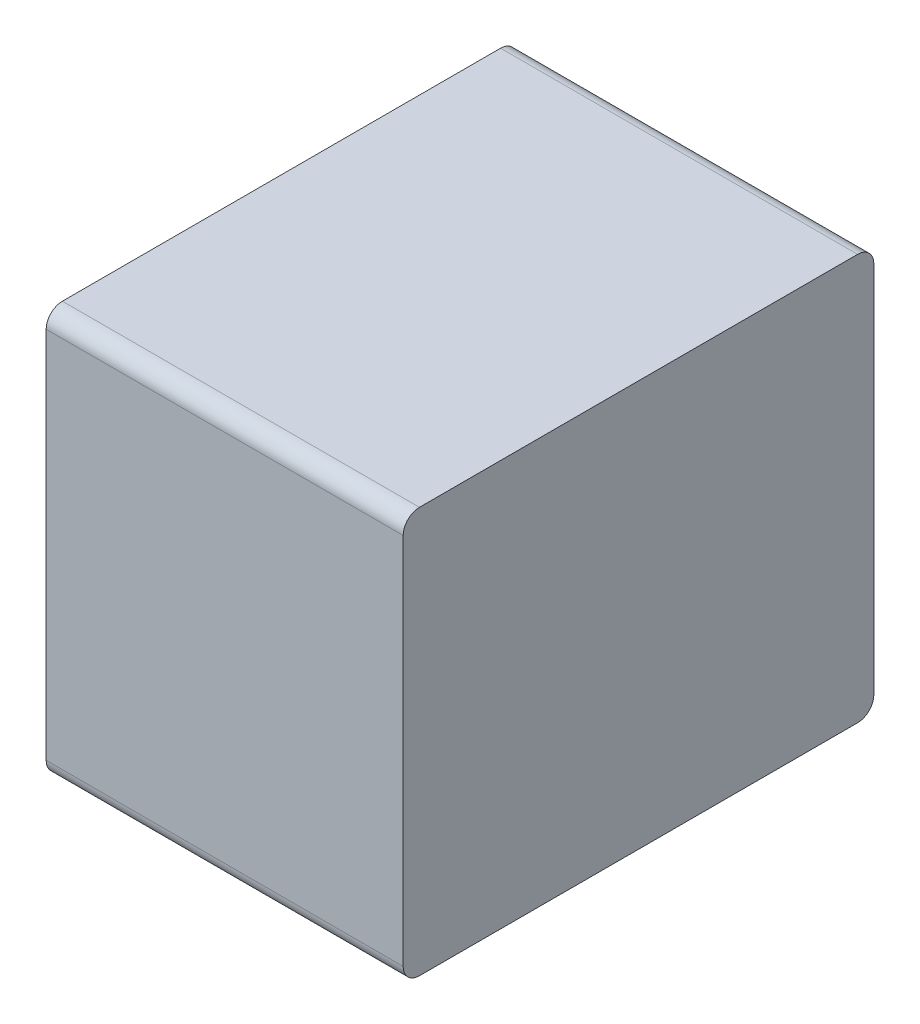
ISO-10303-21;
HEADER;
FILE_DESCRIPTION(('STEP AP214'),'2;1');
FILE_NAME('part.step','',(''),(''),'','','');
FILE_SCHEMA(('AUTOMOTIVE_DESIGN { 1 0 10303 214 1 1 1 1 }'));
ENDSEC;
DATA;
#1=APPLICATION_CONTEXT('core data for automotive mechanical design processes');
#2=APPLICATION_PROTOCOL_DEFINITION('international standard','automotive_design',2000,#1);
#3=PRODUCT_CONTEXT('',#1,'mechanical');
#4=PRODUCT('Part','Part','',(#3));
#5=PRODUCT_RELATED_PRODUCT_CATEGORY('part','',(#4));
#6=PRODUCT_DEFINITION_FORMATION('','',#4);
#7=PRODUCT_DEFINITION_CONTEXT('part definition',#1,'design');
#8=PRODUCT_DEFINITION('design','',#6,#7);
#9=PRODUCT_DEFINITION_SHAPE('','',#8);
#10=(LENGTH_UNIT() NAMED_UNIT(*) SI_UNIT(.MILLI.,.METRE.));
#11=(NAMED_UNIT(*) PLANE_ANGLE_UNIT() SI_UNIT($,.RADIAN.));
#12=(NAMED_UNIT(*) SI_UNIT($,.STERADIAN.) SOLID_ANGLE_UNIT());
#13=UNCERTAINTY_MEASURE_WITH_UNIT(LENGTH_MEASURE(1.E-05),#10,'distance_accuracy_value','');
#14=(GEOMETRIC_REPRESENTATION_CONTEXT(3) GLOBAL_UNCERTAINTY_ASSIGNED_CONTEXT((#13)) GLOBAL_UNIT_ASSIGNED_CONTEXT((#10,
#11,#12)) REPRESENTATION_CONTEXT('',''));
#15=CARTESIAN_POINT('',(0.,0.,0.));
#16=DIRECTION('',(0.,0.,1.));
#17=DIRECTION('',(1.,0.,0.));
#18=AXIS2_PLACEMENT_3D('',#15,#16,#17);
#19=CARTESIAN_POINT('',(0.275,0.575,0.05));
#20=DIRECTION('',(1.,0.,0.));
#21=DIRECTION('',(0.,0.707106781186548,-0.707106781186547));
#22=AXIS2_PLACEMENT_3D('',#19,#20,#21);
#23=CYLINDRICAL_SURFACE('',#22,0.05);
#24=CARTESIAN_POINT('',(0.55,0.575,0.05));
#25=DIRECTION('',(-1.,0.,0.));
#26=DIRECTION('',(0.,0.707106781186548,-0.707106781186547));
#27=AXIS2_PLACEMENT_3D('',#24,#25,#26);
#28=CIRCLE('',#27,0.05);
#29=CARTESIAN_POINT('',(0.55,0.625,0.05));
#30=VERTEX_POINT('',#29);
#31=CARTESIAN_POINT('',(0.55,0.575,0.));
#32=VERTEX_POINT('',#31);
#33=EDGE_CURVE('E11',#30,#32,#28,.T.);
#34=ORIENTED_EDGE('',*,*,#33,.T.);
#35=DIRECTION('',(-1.,0.,0.));
#36=VECTOR('',#35,1.);
#37=CARTESIAN_POINT('',(0.275,0.575,0.));
#38=LINE('',#37,#36);
#39=CARTESIAN_POINT('',(-0.55,0.575,0.));
#40=VERTEX_POINT('',#39);
#41=EDGE_CURVE('E24',#32,#40,#38,.T.);
#42=ORIENTED_EDGE('',*,*,#41,.T.);
#43=CARTESIAN_POINT('',(-0.55,0.575,0.05));
#44=DIRECTION('',(1.,0.,0.));
#45=DIRECTION('',(0.,0.707106781186548,-0.707106781186547));
#46=AXIS2_PLACEMENT_3D('',#43,#44,#45);
#47=CIRCLE('',#46,0.05);
#48=CARTESIAN_POINT('',(-0.55,0.625,0.05));
#49=VERTEX_POINT('',#48);
#50=EDGE_CURVE('E142',#40,#49,#47,.T.);
#51=ORIENTED_EDGE('',*,*,#50,.T.);
#52=DIRECTION('',(1.,0.,0.));
#53=VECTOR('',#52,1.);
#54=CARTESIAN_POINT('',(0.275,0.625,0.05));
#55=LINE('',#54,#53);
#56=EDGE_CURVE('E140',#49,#30,#55,.T.);
#57=ORIENTED_EDGE('',*,*,#56,.T.);
#58=EDGE_LOOP('',(#34,#42,#51,#57));
#59=FACE_BOUND('',#58,.T.);
#60=ADVANCED_FACE('F17',(#59),#23,.T.);
#61=CARTESIAN_POINT('',(0.55,0.625,0.));
#62=DIRECTION('',(0.,1.,0.));
#63=DIRECTION('',(-1.,0.,0.));
#64=AXIS2_PLACEMENT_3D('',#61,#62,#63);
#65=PLANE('',#64);
#66=ORIENTED_EDGE('',*,*,#56,.F.);
#67=DIRECTION('',(0.,0.,1.));
#68=VECTOR('',#67,1.);
#69=CARTESIAN_POINT('',(-0.55,0.625,0.));
#70=LINE('',#69,#68);
#71=CARTESIAN_POINT('',(-0.55,0.625,1.4));
#72=VERTEX_POINT('',#71);
#73=EDGE_CURVE('E138',#49,#72,#70,.T.);
#74=ORIENTED_EDGE('',*,*,#73,.T.);
#75=DIRECTION('',(-1.,0.,0.));
#76=VECTOR('',#75,1.);
#77=CARTESIAN_POINT('',(0.275,0.625,1.4));
#78=LINE('',#77,#76);
#79=CARTESIAN_POINT('',(0.55,0.625,1.4));
#80=VERTEX_POINT('',#79);
#81=EDGE_CURVE('E135',#80,#72,#78,.T.);
#82=ORIENTED_EDGE('',*,*,#81,.F.);
#83=DIRECTION('',(0.,0.,1.));
#84=VECTOR('',#83,1.);
#85=CARTESIAN_POINT('',(0.55,0.625,0.));
#86=LINE('',#85,#84);
#87=EDGE_CURVE('E133',#30,#80,#86,.T.);
#88=ORIENTED_EDGE('',*,*,#87,.F.);
#89=EDGE_LOOP('',(#66,#74,#82,#88));
#90=FACE_BOUND('',#89,.T.);
#91=ADVANCED_FACE('F163',(#90),#65,.T.);
#92=CARTESIAN_POINT('',(-0.55,0.625,0.));
#93=DIRECTION('',(-1.,0.,0.));
#94=DIRECTION('',(0.,-1.,0.));
#95=AXIS2_PLACEMENT_3D('',#92,#93,#94);
#96=PLANE('',#95);
#97=ORIENTED_EDGE('',*,*,#50,.F.);
#98=DIRECTION('',(0.,1.,0.));
#99=VECTOR('',#98,1.);
#100=CARTESIAN_POINT('',(-0.55,-0.625,0.));
#101=LINE('',#100,#99);
#102=CARTESIAN_POINT('',(-0.55,-0.575,0.));
#103=VERTEX_POINT('',#102);
#104=EDGE_CURVE('E130',#103,#40,#101,.T.);
#105=ORIENTED_EDGE('',*,*,#104,.F.);
#106=CARTESIAN_POINT('',(-0.55,-0.575,0.05));
#107=DIRECTION('',(1.,0.,0.));
#108=DIRECTION('',(0.,-0.707106781186548,-0.707106781186547));
#109=AXIS2_PLACEMENT_3D('',#106,#107,#108);
#110=CIRCLE('',#109,0.05);
#111=CARTESIAN_POINT('',(-0.55,-0.625,0.05));
#112=VERTEX_POINT('',#111);
#113=EDGE_CURVE('E127',#112,#103,#110,.T.);
#114=ORIENTED_EDGE('',*,*,#113,.F.);
#115=DIRECTION('',(0.,0.,1.));
#116=VECTOR('',#115,1.);
#117=CARTESIAN_POINT('',(-0.55,-0.625,0.));
#118=LINE('',#117,#116);
#119=CARTESIAN_POINT('',(-0.55,-0.625,1.4));
#120=VERTEX_POINT('',#119);
#121=EDGE_CURVE('E125',#112,#120,#118,.T.);
#122=ORIENTED_EDGE('',*,*,#121,.T.);
#123=CARTESIAN_POINT('',(-0.55,-0.575,1.4));
#124=DIRECTION('',(1.,0.,0.));
#125=DIRECTION('',(0.,-0.707106781186548,0.707106781186548));
#126=AXIS2_PLACEMENT_3D('',#123,#124,#125);
#127=CIRCLE('',#126,0.05);
#128=CARTESIAN_POINT('',(-0.55,-0.575,1.45));
#129=VERTEX_POINT('',#128);
#130=EDGE_CURVE('E123',#129,#120,#127,.T.);
#131=ORIENTED_EDGE('',*,*,#130,.F.);
#132=DIRECTION('',(0.,-1.,0.));
#133=VECTOR('',#132,1.);
#134=CARTESIAN_POINT('',(-0.55,-0.625,1.45));
#135=LINE('',#134,#133);
#136=CARTESIAN_POINT('',(-0.55,0.575,1.45));
#137=VERTEX_POINT('',#136);
#138=EDGE_CURVE('E101',#137,#129,#135,.T.);
#139=ORIENTED_EDGE('',*,*,#138,.F.);
#140=CARTESIAN_POINT('',(-0.55,0.575,1.4));
#141=DIRECTION('',(1.,0.,0.));
#142=DIRECTION('',(0.,0.707106781186548,0.707106781186548));
#143=AXIS2_PLACEMENT_3D('',#140,#141,#142);
#144=CIRCLE('',#143,0.05);
#145=EDGE_CURVE('E119',#72,#137,#144,.T.);
#146=ORIENTED_EDGE('',*,*,#145,.F.);
#147=ORIENTED_EDGE('',*,*,#73,.F.);
#148=EDGE_LOOP('',(#97,#105,#114,#122,#131,#139,#146,#147));
#149=FACE_BOUND('',#148,.T.);
#150=ADVANCED_FACE('F148',(#149),#96,.T.);
#151=CARTESIAN_POINT('',(-0.275,-0.575,0.05));
#152=DIRECTION('',(-1.,0.,0.));
#153=DIRECTION('',(0.,-0.707106781186548,-0.707106781186547));
#154=AXIS2_PLACEMENT_3D('',#151,#152,#153);
#155=CYLINDRICAL_SURFACE('',#154,0.05);
#156=ORIENTED_EDGE('',*,*,#113,.T.);
#157=DIRECTION('',(1.,0.,0.));
#158=VECTOR('',#157,1.);
#159=CARTESIAN_POINT('',(-0.275,-0.575,0.));
#160=LINE('',#159,#158);
#161=CARTESIAN_POINT('',(0.55,-0.575,0.));
#162=VERTEX_POINT('',#161);
#163=EDGE_CURVE('E117',#103,#162,#160,.T.);
#164=ORIENTED_EDGE('',*,*,#163,.T.);
#165=CARTESIAN_POINT('',(0.55,-0.575,0.05));
#166=DIRECTION('',(-1.,0.,0.));
#167=DIRECTION('',(0.,-0.707106781186548,-0.707106781186547));
#168=AXIS2_PLACEMENT_3D('',#165,#166,#167);
#169=CIRCLE('',#168,0.05);
#170=CARTESIAN_POINT('',(0.55,-0.625,0.05));
#171=VERTEX_POINT('',#170);
#172=EDGE_CURVE('E115',#162,#171,#169,.T.);
#173=ORIENTED_EDGE('',*,*,#172,.T.);
#174=DIRECTION('',(-1.,0.,0.));
#175=VECTOR('',#174,1.);
#176=CARTESIAN_POINT('',(-0.275,-0.625,0.05));
#177=LINE('',#176,#175);
#178=EDGE_CURVE('E112',#171,#112,#177,.T.);
#179=ORIENTED_EDGE('',*,*,#178,.T.);
#180=EDGE_LOOP('',(#156,#164,#173,#179));
#181=FACE_BOUND('',#180,.T.);
#182=ADVANCED_FACE('F154',(#181),#155,.T.);
#183=CARTESIAN_POINT('',(-0.55,-0.625,0.));
#184=DIRECTION('',(0.,-1.,0.));
#185=DIRECTION('',(1.,0.,0.));
#186=AXIS2_PLACEMENT_3D('',#183,#184,#185);
#187=PLANE('',#186);
#188=ORIENTED_EDGE('',*,*,#178,.F.);
#189=DIRECTION('',(0.,0.,1.));
#190=VECTOR('',#189,1.);
#191=CARTESIAN_POINT('',(0.55,-0.625,0.));
#192=LINE('',#191,#190);
#193=CARTESIAN_POINT('',(0.55,-0.625,1.4));
#194=VERTEX_POINT('',#193);
#195=EDGE_CURVE('E110',#171,#194,#192,.T.);
#196=ORIENTED_EDGE('',*,*,#195,.T.);
#197=DIRECTION('',(1.,0.,0.));
#198=VECTOR('',#197,1.);
#199=CARTESIAN_POINT('',(-0.275,-0.625,1.4));
#200=LINE('',#199,#198);
#201=EDGE_CURVE('E96',#120,#194,#200,.T.);
#202=ORIENTED_EDGE('',*,*,#201,.F.);
#203=ORIENTED_EDGE('',*,*,#121,.F.);
#204=EDGE_LOOP('',(#188,#196,#202,#203));
#205=FACE_BOUND('',#204,.T.);
#206=ADVANCED_FACE('F157',(#205),#187,.T.);
#207=CARTESIAN_POINT('',(0.55,-0.625,0.));
#208=DIRECTION('',(1.,0.,0.));
#209=DIRECTION('',(0.,1.,0.));
#210=AXIS2_PLACEMENT_3D('',#207,#208,#209);
#211=PLANE('',#210);
#212=ORIENTED_EDGE('',*,*,#33,.F.);
#213=ORIENTED_EDGE('',*,*,#87,.T.);
#214=CARTESIAN_POINT('',(0.55,0.575,1.4));
#215=DIRECTION('',(-1.,0.,0.));
#216=DIRECTION('',(0.,0.707106781186548,0.707106781186548));
#217=AXIS2_PLACEMENT_3D('',#214,#215,#216);
#218=CIRCLE('',#217,0.05);
#219=CARTESIAN_POINT('',(0.55,0.575,1.45));
#220=VERTEX_POINT('',#219);
#221=EDGE_CURVE('E83',#220,#80,#218,.T.);
#222=ORIENTED_EDGE('',*,*,#221,.F.);
#223=DIRECTION('',(0.,1.,0.));
#224=VECTOR('',#223,1.);
#225=CARTESIAN_POINT('',(0.55,0.625,1.45));
#226=LINE('',#225,#224);
#227=CARTESIAN_POINT('',(0.55,-0.575,1.45));
#228=VERTEX_POINT('',#227);
#229=EDGE_CURVE('E77',#228,#220,#226,.T.);
#230=ORIENTED_EDGE('',*,*,#229,.F.);
#231=CARTESIAN_POINT('',(0.55,-0.575,1.4));
#232=DIRECTION('',(-1.,0.,0.));
#233=DIRECTION('',(0.,-0.707106781186548,0.707106781186548));
#234=AXIS2_PLACEMENT_3D('',#231,#232,#233);
#235=CIRCLE('',#234,0.05);
#236=EDGE_CURVE('E81',#194,#228,#235,.T.);
#237=ORIENTED_EDGE('',*,*,#236,.F.);
#238=ORIENTED_EDGE('',*,*,#195,.F.);
#239=ORIENTED_EDGE('',*,*,#172,.F.);
#240=DIRECTION('',(0.,-1.,0.));
#241=VECTOR('',#240,1.);
#242=CARTESIAN_POINT('',(0.55,0.625,0.));
#243=LINE('',#242,#241);
#244=EDGE_CURVE('E97',#32,#162,#243,.T.);
#245=ORIENTED_EDGE('',*,*,#244,.F.);
#246=EDGE_LOOP('',(#212,#213,#222,#230,#237,#238,#239,#245));
#247=FACE_BOUND('',#246,.T.);
#248=ADVANCED_FACE('F79',(#247),#211,.T.);
#249=CARTESIAN_POINT('',(0.275,0.575,1.4));
#250=DIRECTION('',(-1.,0.,0.));
#251=DIRECTION('',(0.,0.707106781186548,0.707106781186548));
#252=AXIS2_PLACEMENT_3D('',#249,#250,#251);
#253=CYLINDRICAL_SURFACE('',#252,0.05);
#254=ORIENTED_EDGE('',*,*,#145,.T.);
#255=DIRECTION('',(1.,0.,0.));
#256=VECTOR('',#255,1.);
#257=CARTESIAN_POINT('',(0.275,0.575,1.45));
#258=LINE('',#257,#256);
#259=EDGE_CURVE('E102',#137,#220,#258,.T.);
#260=ORIENTED_EDGE('',*,*,#259,.T.);
#261=ORIENTED_EDGE('',*,*,#221,.T.);
#262=ORIENTED_EDGE('',*,*,#81,.T.);
#263=EDGE_LOOP('',(#254,#260,#261,#262));
#264=FACE_BOUND('',#263,.T.);
#265=ADVANCED_FACE('F160',(#264),#253,.T.);
#266=CARTESIAN_POINT('',(0.,0.,1.45));
#267=DIRECTION('',(0.,0.,1.));
#268=DIRECTION('',(1.,0.,0.));
#269=AXIS2_PLACEMENT_3D('',#266,#267,#268);
#270=PLANE('',#269);
#271=ORIENTED_EDGE('',*,*,#259,.F.);
#272=ORIENTED_EDGE('',*,*,#138,.T.);
#273=DIRECTION('',(-1.,0.,0.));
#274=VECTOR('',#273,1.);
#275=CARTESIAN_POINT('',(-0.275,-0.575,1.45));
#276=LINE('',#275,#274);
#277=EDGE_CURVE('E94',#228,#129,#276,.T.);
#278=ORIENTED_EDGE('',*,*,#277,.F.);
#279=ORIENTED_EDGE('',*,*,#229,.T.);
#280=EDGE_LOOP('',(#271,#272,#278,#279));
#281=FACE_BOUND('',#280,.T.);
#282=ADVANCED_FACE('F100',(#281),#270,.T.);
#283=CARTESIAN_POINT('',(-0.275,-0.575,1.4));
#284=DIRECTION('',(1.,0.,0.));
#285=DIRECTION('',(0.,-0.707106781186548,0.707106781186548));
#286=AXIS2_PLACEMENT_3D('',#283,#284,#285);
#287=CYLINDRICAL_SURFACE('',#286,0.05);
#288=ORIENTED_EDGE('',*,*,#236,.T.);
#289=ORIENTED_EDGE('',*,*,#277,.T.);
#290=ORIENTED_EDGE('',*,*,#130,.T.);
#291=ORIENTED_EDGE('',*,*,#201,.T.);
#292=EDGE_LOOP('',(#288,#289,#290,#291));
#293=FACE_BOUND('',#292,.T.);
#294=ADVANCED_FACE('F92',(#293),#287,.T.);
#295=CARTESIAN_POINT('',(0.,0.,0.));
#296=DIRECTION('',(0.,0.,1.));
#297=DIRECTION('',(1.,0.,0.));
#298=AXIS2_PLACEMENT_3D('',#295,#296,#297);
#299=PLANE('',#298);
#300=ORIENTED_EDGE('',*,*,#41,.F.);
#301=ORIENTED_EDGE('',*,*,#244,.T.);
#302=ORIENTED_EDGE('',*,*,#163,.F.);
#303=ORIENTED_EDGE('',*,*,#104,.T.);
#304=EDGE_LOOP('',(#300,#301,#302,#303));
#305=FACE_BOUND('',#304,.T.);
#306=ADVANCED_FACE('F151',(#305),#299,.F.);
#307=CLOSED_SHELL('',(#60,#91,#150,#182,#206,#248,#265,#282,#294,#306));
#308=MANIFOLD_SOLID_BREP('B1',#307);
#309=ADVANCED_BREP_SHAPE_REPRESENTATION('',(#18,#308),#14);
#310=SHAPE_DEFINITION_REPRESENTATION(#9,#309);
ENDSEC;
END-ISO-10303-21;
